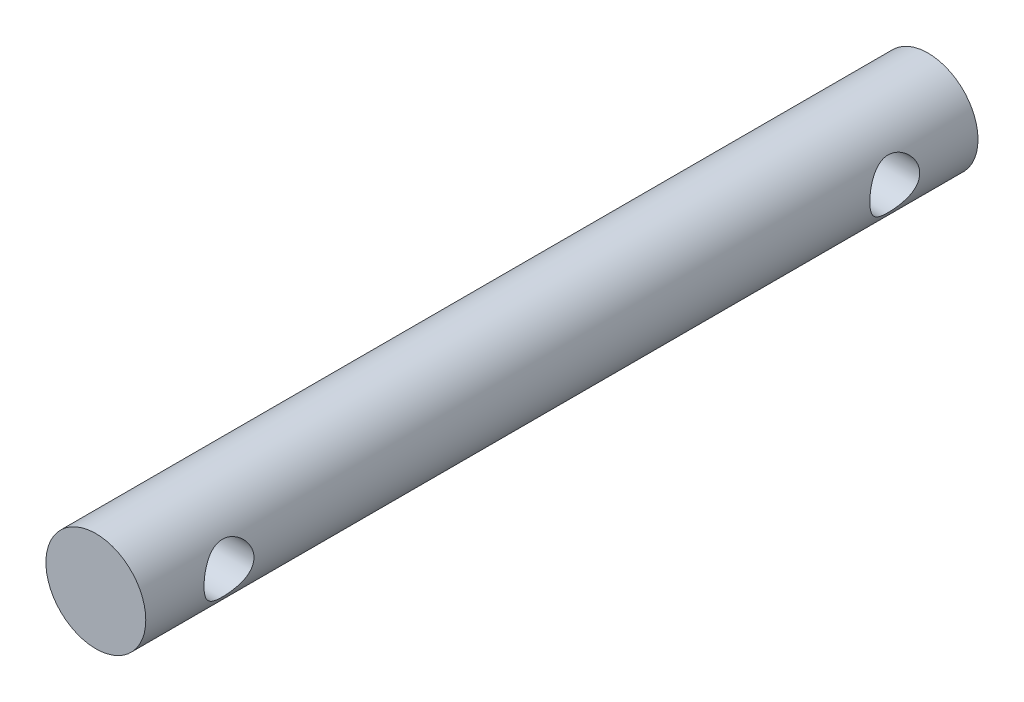
ISO-10303-21;
HEADER;
FILE_DESCRIPTION(('STEP AP214'),'2;1');
FILE_NAME('part.step','',(''),(''),'','','');
FILE_SCHEMA(('AUTOMOTIVE_DESIGN { 1 0 10303 214 1 1 1 1 }'));
ENDSEC;
DATA;
#1=APPLICATION_CONTEXT('core data for automotive mechanical design processes');
#2=APPLICATION_PROTOCOL_DEFINITION('international standard','automotive_design',2000,#1);
#3=PRODUCT_CONTEXT('',#1,'mechanical');
#4=PRODUCT('Part','Part','',(#3));
#5=PRODUCT_RELATED_PRODUCT_CATEGORY('part','',(#4));
#6=PRODUCT_DEFINITION_FORMATION('','',#4);
#7=PRODUCT_DEFINITION_CONTEXT('part definition',#1,'design');
#8=PRODUCT_DEFINITION('design','',#6,#7);
#9=PRODUCT_DEFINITION_SHAPE('','',#8);
#10=(LENGTH_UNIT() NAMED_UNIT(*) SI_UNIT(.MILLI.,.METRE.));
#11=(NAMED_UNIT(*) PLANE_ANGLE_UNIT() SI_UNIT($,.RADIAN.));
#12=(NAMED_UNIT(*) SI_UNIT($,.STERADIAN.) SOLID_ANGLE_UNIT());
#13=UNCERTAINTY_MEASURE_WITH_UNIT(LENGTH_MEASURE(1.E-05),#10,'distance_accuracy_value','');
#14=(GEOMETRIC_REPRESENTATION_CONTEXT(3) GLOBAL_UNCERTAINTY_ASSIGNED_CONTEXT((#13)) GLOBAL_UNIT_ASSIGNED_CONTEXT((#10,
#11,#12)) REPRESENTATION_CONTEXT('',''));
#15=CARTESIAN_POINT('',(0.,0.,0.));
#16=DIRECTION('',(0.,0.,1.));
#17=DIRECTION('',(1.,0.,0.));
#18=AXIS2_PLACEMENT_3D('',#15,#16,#17);
#19=CARTESIAN_POINT('',(0.,0.,50.));
#20=DIRECTION('',(0.,0.,-1.));
#21=DIRECTION('',(-1.,0.,0.));
#22=AXIS2_PLACEMENT_3D('',#19,#20,#21);
#23=CYLINDRICAL_SURFACE('',#22,3.);
#24=CARTESIAN_POINT('',(-3.,0.,46.5));
#25=CARTESIAN_POINT('',(-2.99999570107562,-0.0788579444268501,46.4999950465242));
#26=CARTESIAN_POINT('',(-2.99685736529635,-0.157809899546343,46.4937448903184));
#27=CARTESIAN_POINT('',(-2.98461234055736,-0.313380352903344,46.4690206794877));
#28=CARTESIAN_POINT('',(-2.97549431743379,-0.389994130070445,46.4505234105033));
#29=CARTESIAN_POINT('',(-2.95224419105063,-0.538400317320673,46.4022092870751));
#30=CARTESIAN_POINT('',(-2.93813158766306,-0.610210204408719,46.3724364236281));
#31=CARTESIAN_POINT('',(-2.90618664773642,-0.747708925209898,46.3026440679525));
#32=CARTESIAN_POINT('',(-2.88835460450288,-0.813398240985089,46.2626253836267));
#33=CARTESIAN_POINT('',(-2.84934387387093,-0.941261726642865,46.1707241257721));
#34=CARTESIAN_POINT('',(-2.82802798691306,-1.00298281668316,46.1182702811406));
#35=CARTESIAN_POINT('',(-2.78489955370115,-1.11716916730047,46.0042177811295));
#36=CARTESIAN_POINT('',(-2.76308664313552,-1.16962737466015,45.9426122223413));
#37=CARTESIAN_POINT('',(-2.71948426796021,-1.26787800067542,45.8062749757149));
#38=CARTESIAN_POINT('',(-2.69782780455198,-1.31283800332746,45.7308958524811));
#39=CARTESIAN_POINT('',(-2.65928968158481,-1.38925234033605,45.5724489960207));
#40=CARTESIAN_POINT('',(-2.64240461410484,-1.4207163224495,45.4893868069159));
#41=CARTESIAN_POINT('',(-2.61686800556713,-1.46719866328289,45.3230023418671));
#42=CARTESIAN_POINT('',(-2.6077840737557,-1.48308878562067,45.2399933218989));
#43=CARTESIAN_POINT('',(-2.59772834922791,-1.50064048996327,45.0720317433308));
#44=CARTESIAN_POINT('',(-2.59674854014932,-1.50231613255961,44.9870811886933));
#45=CARTESIAN_POINT('',(-2.60266395385873,-1.49203093075844,44.828570963527));
#46=CARTESIAN_POINT('',(-2.6086314549302,-1.48167683930524,44.7548639531654));
#47=CARTESIAN_POINT('',(-2.62614343100775,-1.4504097735854,44.6104171359404));
#48=CARTESIAN_POINT('',(-2.63768968247664,-1.42949343584648,44.539678282042));
#49=CARTESIAN_POINT('',(-2.66531214619111,-1.37731467057901,44.4011563011515));
#50=CARTESIAN_POINT('',(-2.68148760995998,-1.34582260067399,44.3334804018213));
#51=CARTESIAN_POINT('',(-2.71655106422106,-1.273562531502,44.204048561115));
#52=CARTESIAN_POINT('',(-2.73544027170286,-1.2327903657187,44.1422952965999));
#53=CARTESIAN_POINT('',(-2.77669736854929,-1.13709908236918,44.0182181208852));
#54=CARTESIAN_POINT('',(-2.79920265355119,-1.08104168755392,43.9568146896358));
#55=CARTESIAN_POINT('',(-2.84321434950611,-0.959333368112057,43.8438968721137));
#56=CARTESIAN_POINT('',(-2.86472027938201,-0.893677884861427,43.7923872119492));
#57=CARTESIAN_POINT('',(-2.90552980924446,-0.750774758747772,43.6984715084554));
#58=CARTESIAN_POINT('',(-2.92468476243011,-0.673130387399111,43.6565992913314));
#59=CARTESIAN_POINT('',(-2.95736821681863,-0.510699323233193,43.5868544564355));
#60=CARTESIAN_POINT('',(-2.9709011841533,-0.425918364397913,43.5589707224773));
#61=CARTESIAN_POINT('',(-2.98986500612153,-0.259149737491054,43.520286894425));
#62=CARTESIAN_POINT('',(-2.99587407451965,-0.17751229582249,43.5082631463798));
#63=CARTESIAN_POINT('',(-3.00109520188655,-0.0131693999240295,43.4978029032983));
#64=CARTESIAN_POINT('',(-3.00031048081978,0.0695355298048604,43.4993599715408));
#65=CARTESIAN_POINT('',(-2.99236788380152,0.226849457978976,43.5153100326281));
#66=CARTESIAN_POINT('',(-2.98570868532253,0.301589112074889,43.528698799095));
#67=CARTESIAN_POINT('',(-2.9673325697226,0.447610338452907,43.5663571078427));
#68=CARTESIAN_POINT('',(-2.95561509501618,0.518891528536628,43.5906278496802));
#69=CARTESIAN_POINT('',(-2.92776377120382,0.658332912674358,43.6499976996495));
#70=CARTESIAN_POINT('',(-2.91151322654446,0.726345595508704,43.6853865751744));
#71=CARTESIAN_POINT('',(-2.87615961476126,0.855692042548907,43.7656613034698));
#72=CARTESIAN_POINT('',(-2.85705533350407,0.917022944664888,43.8105512018931));
#73=CARTESIAN_POINT('',(-2.81562332004297,1.03765153393382,43.9136406379961));
#74=CARTESIAN_POINT('',(-2.79316327265249,1.09615811672854,43.9727143026677));
#75=CARTESIAN_POINT('',(-2.7489358741323,1.20278448167829,44.0998877269166));
#76=CARTESIAN_POINT('',(-2.72716901100071,1.25089707856781,44.1679936782719));
#77=CARTESIAN_POINT('',(-2.68576788309734,1.33756187171853,44.3154654812595));
#78=CARTESIAN_POINT('',(-2.66628794383591,1.37553824370037,44.3952168991417));
#79=CARTESIAN_POINT('',(-2.63361108441202,1.43712423890206,44.5612651013625));
#80=CARTESIAN_POINT('',(-2.62040607332625,1.46075237380053,44.6475532897003));
#81=CARTESIAN_POINT('',(-2.60342251538703,1.49079253120031,44.8153653343271));
#82=CARTESIAN_POINT('',(-2.59886075197597,1.49863949460818,44.8965513801529));
#83=CARTESIAN_POINT('',(-2.59748031962405,1.50103373156431,45.0591706007468));
#84=CARTESIAN_POINT('',(-2.60065829439585,1.49558676993487,45.1406036531068));
#85=CARTESIAN_POINT('',(-2.61356793076615,1.47288918838997,45.2932252523002));
#86=CARTESIAN_POINT('',(-2.62264641723987,1.45681247151456,45.3646507052171));
#87=CARTESIAN_POINT('',(-2.64556524281479,1.41476303733662,45.5037121791365));
#88=CARTESIAN_POINT('',(-2.65940711354502,1.38878713673989,45.571346973138));
#89=CARTESIAN_POINT('',(-2.69142795546803,1.32572361795085,45.7059372764798));
#90=CARTESIAN_POINT('',(-2.7098358359388,1.28800670672356,45.7725418527436));
#91=CARTESIAN_POINT('',(-2.7485299745229,1.2032264574561,45.8989118042719));
#92=CARTESIAN_POINT('',(-2.76881720693416,1.15615825686235,45.9586735957817));
#93=CARTESIAN_POINT('',(-2.81193484737138,1.04730498999207,46.077212973532));
#94=CARTESIAN_POINT('',(-2.83477474959942,0.9844266344959,46.1349886535254));
#95=CARTESIAN_POINT('',(-2.87816628389896,0.849232209349804,46.2393944751529));
#96=CARTESIAN_POINT('',(-2.89871667939292,0.776911084957805,46.2860186092049));
#97=CARTESIAN_POINT('',(-2.93547014349806,0.623897395174429,46.3668545440681));
#98=CARTESIAN_POINT('',(-2.95164144740899,0.543149255665107,46.4009762538547));
#99=CARTESIAN_POINT('',(-2.9775201194848,0.37611315170714,46.4547122516361));
#100=CARTESIAN_POINT('',(-2.98724585044602,0.289841699383658,46.4743677702086));
#101=CARTESIAN_POINT('',(-2.99543192870217,0.168902919736349,46.4908461166286));
#102=CARTESIAN_POINT('',(-2.99714048010376,0.135242819162352,46.4942739612995));
#103=CARTESIAN_POINT('',(-2.99942545465223,0.0677275977076395,46.4988519982711));
#104=CARTESIAN_POINT('',(-3.00000184655071,0.0338724714699437,46.5000021277053));
#105=CARTESIAN_POINT('',(-3.,0.,46.5));
#106=B_SPLINE_CURVE_WITH_KNOTS('',3,(#24,#25,#26,#27,#28,#29,#30,#31,#32,#33,#34,#35,#36,#37,
#38,#39,#40,#41,#42,#43,#44,#45,#46,#47,#48,#49,#50,#51,#52,#53,#54,#55,#56,#57,#58,#59,#60,#61,
#62,#63,#64,#65,#66,#67,#68,#69,#70,#71,#72,#73,#74,#75,#76,#77,#78,#79,#80,#81,#82,#83,#84,#85,
#86,#87,#88,#89,#90,#91,#92,#93,#94,#95,#96,#97,#98,#99,#100,#101,#102,#103,#104,#105),
.UNSPECIFIED.,.T.,.F.,(4,2,2,2,2,2,2,2,2,2,2,2,2,2,2,2,2,2,2,2,2,2,2,2,2,2,2,2,2,2,2,2,2,2,2,2,
2,2,2,2,4),(0.,0.236436386130438,0.473322224563797,0.709293233238445,0.945245640872351,
1.19547263807713,1.44588935648105,1.71572589646129,1.98536921847422,2.23887018210345,
2.49212035993531,2.71508568613981,2.93812205888518,3.16635360252732,3.39468781890334,
3.65197412000819,3.90938301898031,4.17874533321662,4.44789325368421,4.6947493570702,
4.94148846767215,5.16910359759184,5.39674382446398,5.63089284041849,5.8651417612251,
6.12239415966629,6.3798238292315,6.6497202324259,6.91926767918177,7.16293961254572,
7.40650589797019,7.62686895373285,7.84730293182528,8.08254685170432,8.31791341715448,
8.58187864135759,8.8459857507187,9.11196020495292,9.37717362931726,9.47872920200878,
9.58028757766602),.UNSPECIFIED.);
#107=CARTESIAN_POINT('',(-3.,0.,46.5));
#108=VERTEX_POINT('',#107);
#109=EDGE_CURVE('E10',#108,#108,#106,.T.);
#110=ORIENTED_EDGE('',*,*,#109,.T.);
#111=EDGE_LOOP('',(#110));
#112=FACE_BOUND('',#111,.T.);
#113=CARTESIAN_POINT('',(3.,0.,43.5));
#114=CARTESIAN_POINT('',(2.99999570107562,-0.0788579444268496,43.5000049534758));
#115=CARTESIAN_POINT('',(2.99685736529635,-0.157809899546343,43.5062551096816));
#116=CARTESIAN_POINT('',(2.98461234055736,-0.313380352903344,43.5309793205123));
#117=CARTESIAN_POINT('',(2.97549431743379,-0.389994130070444,43.5494765894967));
#118=CARTESIAN_POINT('',(2.95224419105063,-0.538400317320673,43.5977907129249));
#119=CARTESIAN_POINT('',(2.93813158766306,-0.610210204408718,43.6275635763719));
#120=CARTESIAN_POINT('',(2.90618664773642,-0.747708925209898,43.6973559320475));
#121=CARTESIAN_POINT('',(2.88835460450288,-0.813398240985089,43.7373746163733));
#122=CARTESIAN_POINT('',(2.84934387387093,-0.941261726642865,43.8292758742279));
#123=CARTESIAN_POINT('',(2.82802798691306,-1.00298281668316,43.8817297188595));
#124=CARTESIAN_POINT('',(2.78489955370115,-1.11716916730047,43.9957822188706));
#125=CARTESIAN_POINT('',(2.76308664313552,-1.16962737466015,44.0573877776587));
#126=CARTESIAN_POINT('',(2.71948426796021,-1.26787800067542,44.1937250242851));
#127=CARTESIAN_POINT('',(2.69782780455198,-1.31283800332746,44.2691041475189));
#128=CARTESIAN_POINT('',(2.65928968158481,-1.38925234033605,44.4275510039793));
#129=CARTESIAN_POINT('',(2.64240461410484,-1.4207163224495,44.5106131930841));
#130=CARTESIAN_POINT('',(2.61686800556713,-1.46719866328289,44.6769976581329));
#131=CARTESIAN_POINT('',(2.6077840737557,-1.48308878562066,44.7600066781011));
#132=CARTESIAN_POINT('',(2.59772834922791,-1.50064048996327,44.9279682566692));
#133=CARTESIAN_POINT('',(2.59674854014932,-1.50231613255961,45.0129188113067));
#134=CARTESIAN_POINT('',(2.60266395385873,-1.49203093075844,45.1714290364731));
#135=CARTESIAN_POINT('',(2.6086314549302,-1.48167683930524,45.2451360468346));
#136=CARTESIAN_POINT('',(2.62614343100775,-1.4504097735854,45.3895828640596));
#137=CARTESIAN_POINT('',(2.63768968247664,-1.42949343584648,45.460321717958));
#138=CARTESIAN_POINT('',(2.66531214619111,-1.37731467057901,45.5988436988485));
#139=CARTESIAN_POINT('',(2.68148760995998,-1.34582260067399,45.6665195981787));
#140=CARTESIAN_POINT('',(2.71655106422105,-1.27356253150201,45.795951438885));
#141=CARTESIAN_POINT('',(2.73544027170286,-1.23279036571871,45.8577047034001));
#142=CARTESIAN_POINT('',(2.77669736854928,-1.13709908236919,45.9817818791148));
#143=CARTESIAN_POINT('',(2.79920265355119,-1.08104168755393,46.0431853103642));
#144=CARTESIAN_POINT('',(2.84321434950611,-0.959333368112067,46.1561031278864));
#145=CARTESIAN_POINT('',(2.86472027938201,-0.893677884861434,46.2076127880508));
#146=CARTESIAN_POINT('',(2.90552980924446,-0.750774758747777,46.3015284915446));
#147=CARTESIAN_POINT('',(2.92468476243011,-0.673130387399116,46.3434007086686));
#148=CARTESIAN_POINT('',(2.95736821681863,-0.510699323233196,46.4131455435645));
#149=CARTESIAN_POINT('',(2.9709011841533,-0.425918364397914,46.4410292775228));
#150=CARTESIAN_POINT('',(2.98986500612153,-0.259149737491053,46.479713105575));
#151=CARTESIAN_POINT('',(2.99587407451965,-0.17751229582249,46.4917368536202));
#152=CARTESIAN_POINT('',(3.00109520188655,-0.0131693999240284,46.5021970967017));
#153=CARTESIAN_POINT('',(3.00031048081978,0.0695355298048616,46.5006400284592));
#154=CARTESIAN_POINT('',(2.99236788380152,0.226849457978979,46.4846899673719));
#155=CARTESIAN_POINT('',(2.98570868532253,0.301589112074894,46.471301200905));
#156=CARTESIAN_POINT('',(2.9673325697226,0.447610338452912,46.4336428921573));
#157=CARTESIAN_POINT('',(2.95561509501618,0.518891528536631,46.4093721503198));
#158=CARTESIAN_POINT('',(2.92776377120382,0.658332912674361,46.3500023003505));
#159=CARTESIAN_POINT('',(2.91151322654446,0.726345595508708,46.3146134248256));
#160=CARTESIAN_POINT('',(2.87615961476126,0.85569204254891,46.2343386965302));
#161=CARTESIAN_POINT('',(2.85705533350407,0.91702294466489,46.1894487981069));
#162=CARTESIAN_POINT('',(2.81562332004297,1.03765153393383,46.0863593620039));
#163=CARTESIAN_POINT('',(2.79316327265249,1.09615811672854,46.0272856973323));
#164=CARTESIAN_POINT('',(2.7489358741323,1.20278448167829,45.9001122730834));
#165=CARTESIAN_POINT('',(2.7271690110007,1.25089707856781,45.8320063217281));
#166=CARTESIAN_POINT('',(2.68576788309734,1.33756187171853,45.6845345187405));
#167=CARTESIAN_POINT('',(2.66628794383591,1.37553824370037,45.6047831008583));
#168=CARTESIAN_POINT('',(2.63361108441202,1.43712423890206,45.4387348986376));
#169=CARTESIAN_POINT('',(2.62040607332625,1.46075237380053,45.3524467102997));
#170=CARTESIAN_POINT('',(2.60342251538703,1.49079253120031,45.184634665673));
#171=CARTESIAN_POINT('',(2.59886075197597,1.49863949460818,45.1034486198471));
#172=CARTESIAN_POINT('',(2.59748031962405,1.50103373156431,44.9408293992532));
#173=CARTESIAN_POINT('',(2.60065829439585,1.49558676993487,44.8593963468932));
#174=CARTESIAN_POINT('',(2.61356793076615,1.47288918838997,44.7067747476999));
#175=CARTESIAN_POINT('',(2.62264641723987,1.45681247151456,44.6353492947829));
#176=CARTESIAN_POINT('',(2.64556524281479,1.41476303733662,44.4962878208635));
#177=CARTESIAN_POINT('',(2.65940711354502,1.38878713673989,44.428653026862));
#178=CARTESIAN_POINT('',(2.69142795546803,1.32572361795085,44.2940627235202));
#179=CARTESIAN_POINT('',(2.70983583593881,1.28800670672355,44.2274581472565));
#180=CARTESIAN_POINT('',(2.7485299745229,1.20322645745609,44.1010881957281));
#181=CARTESIAN_POINT('',(2.76881720693416,1.15615825686235,44.0413264042183));
#182=CARTESIAN_POINT('',(2.81193484737138,1.04730498999207,43.922787026468));
#183=CARTESIAN_POINT('',(2.83477474959942,0.984426634495898,43.8650113464746));
#184=CARTESIAN_POINT('',(2.87816628389896,0.849232209349802,43.7606055248471));
#185=CARTESIAN_POINT('',(2.89871667939292,0.776911084957803,43.7139813907951));
#186=CARTESIAN_POINT('',(2.93547014349806,0.623897395174428,43.6331454559319));
#187=CARTESIAN_POINT('',(2.95164144740899,0.543149255665106,43.5990237461453));
#188=CARTESIAN_POINT('',(2.9775201194848,0.376113151707138,43.5452877483639));
#189=CARTESIAN_POINT('',(2.98724585044602,0.289841699383656,43.5256322297914));
#190=CARTESIAN_POINT('',(2.99543192870217,0.168902919736346,43.5091538833714));
#191=CARTESIAN_POINT('',(2.99714048010376,0.13524281916235,43.5057260387005));
#192=CARTESIAN_POINT('',(2.99942545465223,0.067727597707639,43.5011480017289));
#193=CARTESIAN_POINT('',(3.00000184655071,0.0338724714699439,43.4999978722947));
#194=CARTESIAN_POINT('',(3.,0.,43.5));
#195=B_SPLINE_CURVE_WITH_KNOTS('',3,(#113,#114,#115,#116,#117,#118,#119,#120,#121,#122,#123,
#124,#125,#126,#127,#128,#129,#130,#131,#132,#133,#134,#135,#136,#137,#138,#139,#140,#141,#142,
#143,#144,#145,#146,#147,#148,#149,#150,#151,#152,#153,#154,#155,#156,#157,#158,#159,#160,#161,
#162,#163,#164,#165,#166,#167,#168,#169,#170,#171,#172,#173,#174,#175,#176,#177,#178,#179,#180,
#181,#182,#183,#184,#185,#186,#187,#188,#189,#190,#191,#192,#193,#194),.UNSPECIFIED.,.T.,.F.,(4,
2,2,2,2,2,2,2,2,2,2,2,2,2,2,2,2,2,2,2,2,2,2,2,2,2,2,2,2,2,2,2,2,2,2,2,2,2,2,2,4),(0.,
0.236436386130439,0.473322224563797,0.709293233238445,0.945245640872351,1.19547263807713,
1.44588935648105,1.71572589646129,1.98536921847422,2.23887018210345,2.49212035993531,
2.71508568613981,2.93812205888519,3.16635360252731,3.39468781890333,3.65197412000818,
3.9093830189803,4.17874533321662,4.44789325368421,4.6947493570702,4.94148846767215,
5.16910359759184,5.39674382446398,5.6308928404185,5.8651417612251,6.1223941596663,
6.37982382923149,6.64972023242589,6.91926767918177,7.16293961254571,7.40650589797019,
7.62686895373286,7.84730293182529,8.08254685170432,8.31791341715448,8.58187864135759,
8.8459857507187,9.11196020495291,9.37717362931726,9.47872920200877,9.58028757766601),.UNSPECIFIED.);
#196=CARTESIAN_POINT('',(3.,0.,43.5));
#197=VERTEX_POINT('',#196);
#198=EDGE_CURVE('E42',#197,#197,#195,.T.);
#199=ORIENTED_EDGE('',*,*,#198,.T.);
#200=EDGE_LOOP('',(#199));
#201=FACE_BOUND('',#200,.T.);
#202=CARTESIAN_POINT('',(-3.,0.,6.49999999999999));
#203=CARTESIAN_POINT('',(-2.99999570107562,-0.0788579444268507,6.4999950465242));
#204=CARTESIAN_POINT('',(-2.99685736529635,-0.157809899546345,6.49374489031841));
#205=CARTESIAN_POINT('',(-2.98461234055736,-0.313380352903345,6.4690206794877));
#206=CARTESIAN_POINT('',(-2.97549431743379,-0.389994130070445,6.45052341050328));
#207=CARTESIAN_POINT('',(-2.95224419105063,-0.538400317320673,6.40220928707506));
#208=CARTESIAN_POINT('',(-2.93813158766306,-0.610210204408719,6.37243642362805));
#209=CARTESIAN_POINT('',(-2.90618664773642,-0.747708925209898,6.30264406795252));
#210=CARTESIAN_POINT('',(-2.88835460450288,-0.813398240985089,6.2626253836267));
#211=CARTESIAN_POINT('',(-2.84934387387093,-0.941261726642864,6.17072412577207));
#212=CARTESIAN_POINT('',(-2.82802798691306,-1.00298281668316,6.11827028114054));
#213=CARTESIAN_POINT('',(-2.78489955370115,-1.11716916730047,6.00421778112945));
#214=CARTESIAN_POINT('',(-2.76308664313552,-1.16962737466015,5.94261222234134));
#215=CARTESIAN_POINT('',(-2.71948426796021,-1.26787800067542,5.80627497571493));
#216=CARTESIAN_POINT('',(-2.69782780455198,-1.31283800332746,5.73089585248113));
#217=CARTESIAN_POINT('',(-2.65928968158481,-1.38925234033604,5.57244899602068));
#218=CARTESIAN_POINT('',(-2.64240461410484,-1.4207163224495,5.48938680691588));
#219=CARTESIAN_POINT('',(-2.61686800556713,-1.46719866328288,5.32300234186712));
#220=CARTESIAN_POINT('',(-2.6077840737557,-1.48308878562066,5.23999332189891));
#221=CARTESIAN_POINT('',(-2.59772834922792,-1.50064048996327,5.07203174333078));
#222=CARTESIAN_POINT('',(-2.59674854014932,-1.50231613255961,4.98708118869327));
#223=CARTESIAN_POINT('',(-2.60266395385873,-1.49203093075844,4.82857096352695));
#224=CARTESIAN_POINT('',(-2.6086314549302,-1.48167683930523,4.75486395316543));
#225=CARTESIAN_POINT('',(-2.62614343100775,-1.4504097735854,4.61041713594044));
#226=CARTESIAN_POINT('',(-2.63768968247664,-1.42949343584648,4.53967828204203));
#227=CARTESIAN_POINT('',(-2.66531214619112,-1.37731467057901,4.40115630115151));
#228=CARTESIAN_POINT('',(-2.68148760995998,-1.34582260067399,4.33348040182132));
#229=CARTESIAN_POINT('',(-2.71655106422106,-1.273562531502,4.20404856111499));
#230=CARTESIAN_POINT('',(-2.73544027170286,-1.2327903657187,4.14229529659987));
#231=CARTESIAN_POINT('',(-2.77669736854929,-1.13709908236918,4.01821812088516));
#232=CARTESIAN_POINT('',(-2.79920265355119,-1.08104168755392,3.95681468963576));
#233=CARTESIAN_POINT('',(-2.84321434950611,-0.959333368112061,3.84389687211365));
#234=CARTESIAN_POINT('',(-2.86472027938201,-0.893677884861429,3.79238721194918));
#235=CARTESIAN_POINT('',(-2.90552980924446,-0.750774758747774,3.69847150845541));
#236=CARTESIAN_POINT('',(-2.92468476243011,-0.673130387399114,3.65659929133139));
#237=CARTESIAN_POINT('',(-2.95736821681863,-0.510699323233196,3.58685445643549));
#238=CARTESIAN_POINT('',(-2.9709011841533,-0.425918364397915,3.55897072247725));
#239=CARTESIAN_POINT('',(-2.98986500612153,-0.259149737491054,3.52028689442498));
#240=CARTESIAN_POINT('',(-2.99587407451965,-0.17751229582249,3.50826314637983));
#241=CARTESIAN_POINT('',(-3.00109520188655,-0.0131693999240281,3.49780290329827));
#242=CARTESIAN_POINT('',(-3.00031048081978,0.0695355298048625,3.4993599715408));
#243=CARTESIAN_POINT('',(-2.99236788380152,0.22684945797898,3.51531003262811));
#244=CARTESIAN_POINT('',(-2.98570868532253,0.301589112074895,3.52869879909499));
#245=CARTESIAN_POINT('',(-2.9673325697226,0.447610338452911,3.56635710784268));
#246=CARTESIAN_POINT('',(-2.95561509501618,0.51889152853663,3.59062784968024));
#247=CARTESIAN_POINT('',(-2.92776377120382,0.658332912674359,3.64999769964955));
#248=CARTESIAN_POINT('',(-2.91151322654446,0.726345595508704,3.68538657517443));
#249=CARTESIAN_POINT('',(-2.87615961476126,0.855692042548907,3.76566130346985));
#250=CARTESIAN_POINT('',(-2.85705533350407,0.917022944664887,3.81055120189309));
#251=CARTESIAN_POINT('',(-2.81562332004297,1.03765153393382,3.91364063799607));
#252=CARTESIAN_POINT('',(-2.79316327265249,1.09615811672854,3.97271430266772));
#253=CARTESIAN_POINT('',(-2.7489358741323,1.20278448167828,4.09988772691659));
#254=CARTESIAN_POINT('',(-2.72716901100071,1.25089707856781,4.16799367827188));
#255=CARTESIAN_POINT('',(-2.68576788309734,1.33756187171853,4.31546548125946));
#256=CARTESIAN_POINT('',(-2.66628794383591,1.37553824370037,4.39521689914172));
#257=CARTESIAN_POINT('',(-2.63361108441202,1.43712423890206,4.56126510136245));
#258=CARTESIAN_POINT('',(-2.62040607332625,1.46075237380052,4.64755328970033));
#259=CARTESIAN_POINT('',(-2.60342251538703,1.49079253120031,4.81536533432705));
#260=CARTESIAN_POINT('',(-2.59886075197597,1.49863949460818,4.89655138015286));
#261=CARTESIAN_POINT('',(-2.59748031962405,1.5010337315643,5.05917060074679));
#262=CARTESIAN_POINT('',(-2.60065829439585,1.49558676993486,5.14060365310679));
#263=CARTESIAN_POINT('',(-2.61356793076615,1.47288918838997,5.29322525230016));
#264=CARTESIAN_POINT('',(-2.62264641723988,1.45681247151455,5.36465070521711));
#265=CARTESIAN_POINT('',(-2.64556524281479,1.41476303733662,5.50371217913655));
#266=CARTESIAN_POINT('',(-2.65940711354503,1.38878713673988,5.57134697313805));
#267=CARTESIAN_POINT('',(-2.69142795546804,1.32572361795085,5.70593727647981));
#268=CARTESIAN_POINT('',(-2.70983583593881,1.28800670672355,5.77254185274354));
#269=CARTESIAN_POINT('',(-2.74852997452291,1.20322645745609,5.89891180427189));
#270=CARTESIAN_POINT('',(-2.76881720693416,1.15615825686234,5.95867359578167));
#271=CARTESIAN_POINT('',(-2.81193484737138,1.04730498999206,6.07721297353201));
#272=CARTESIAN_POINT('',(-2.83477474959942,0.984426634495893,6.13498865352544));
#273=CARTESIAN_POINT('',(-2.87816628389896,0.849232209349797,6.2393944751529));
#274=CARTESIAN_POINT('',(-2.89871667939293,0.776911084957797,6.28601860920486));
#275=CARTESIAN_POINT('',(-2.93547014349806,0.62389739517442,6.3668545440681));
#276=CARTESIAN_POINT('',(-2.95164144740899,0.543149255665097,6.4009762538547));
#277=CARTESIAN_POINT('',(-2.9775201194848,0.376113151707131,6.45471225163611));
#278=CARTESIAN_POINT('',(-2.98724585044602,0.289841699383651,6.47436777020857));
#279=CARTESIAN_POINT('',(-2.99543192870217,0.168902919736344,6.49084611662861));
#280=CARTESIAN_POINT('',(-2.99714048010376,0.135242819162348,6.49427396129951));
#281=CARTESIAN_POINT('',(-2.99942545465223,0.0677275977076376,6.49885199827113));
#282=CARTESIAN_POINT('',(-3.00000184655071,0.0338724714699428,6.50000212770531));
#283=CARTESIAN_POINT('',(-3.,0.,6.49999999999999));
#284=B_SPLINE_CURVE_WITH_KNOTS('',3,(#202,#203,#204,#205,#206,#207,#208,#209,#210,#211,#212,
#213,#214,#215,#216,#217,#218,#219,#220,#221,#222,#223,#224,#225,#226,#227,#228,#229,#230,#231,
#232,#233,#234,#235,#236,#237,#238,#239,#240,#241,#242,#243,#244,#245,#246,#247,#248,#249,#250,
#251,#252,#253,#254,#255,#256,#257,#258,#259,#260,#261,#262,#263,#264,#265,#266,#267,#268,#269,
#270,#271,#272,#273,#274,#275,#276,#277,#278,#279,#280,#281,#282,#283),.UNSPECIFIED.,.T.,.F.,(4,
2,2,2,2,2,2,2,2,2,2,2,2,2,2,2,2,2,2,2,2,2,2,2,2,2,2,2,2,2,2,2,2,2,2,2,2,2,2,2,4),(0.,
0.236436386130439,0.473322224563796,0.709293233238446,0.945245640872351,1.19547263807713,
1.44588935648105,1.71572589646129,1.98536921847421,2.23887018210344,2.49212035993531,
2.71508568613981,2.93812205888518,3.16635360252731,3.39468781890333,3.65197412000818,
3.90938301898029,4.17874533321661,4.44789325368419,4.69474935707018,4.94148846767214,
5.16910359759183,5.39674382446397,5.63089284041848,5.86514176122509,6.12239415966628,
6.37982382923148,6.64972023242589,6.91926767918176,7.1629396125457,7.40650589797018,
7.62686895373284,7.84730293182527,8.08254685170431,8.31791341715446,8.58187864135757,
8.84598575071869,9.1119602049529,9.37717362931724,9.47872920200875,9.58028757766599),.UNSPECIFIED.);
#285=CARTESIAN_POINT('',(-3.,0.,6.49999999999999));
#286=VERTEX_POINT('',#285);
#287=EDGE_CURVE('E46',#286,#286,#284,.T.);
#288=ORIENTED_EDGE('',*,*,#287,.T.);
#289=EDGE_LOOP('',(#288));
#290=FACE_BOUND('',#289,.T.);
#291=CARTESIAN_POINT('',(3.,0.,3.5));
#292=CARTESIAN_POINT('',(2.99999570107562,-0.0788579444268502,3.50000495347579));
#293=CARTESIAN_POINT('',(2.99685736529635,-0.157809899546344,3.50625510968158));
#294=CARTESIAN_POINT('',(2.98461234055736,-0.313380352903344,3.53097932051231));
#295=CARTESIAN_POINT('',(2.97549431743379,-0.389994130070444,3.54947658949672));
#296=CARTESIAN_POINT('',(2.95224419105063,-0.538400317320674,3.59779071292494));
#297=CARTESIAN_POINT('',(2.93813158766306,-0.61021020440872,3.62756357637195));
#298=CARTESIAN_POINT('',(2.90618664773642,-0.747708925209898,3.69735593204748));
#299=CARTESIAN_POINT('',(2.88835460450288,-0.813398240985089,3.7373746163733));
#300=CARTESIAN_POINT('',(2.84934387387093,-0.941261726642864,3.82927587422793));
#301=CARTESIAN_POINT('',(2.82802798691306,-1.00298281668316,3.88172971885946));
#302=CARTESIAN_POINT('',(2.78489955370115,-1.11716916730047,3.99578221887056));
#303=CARTESIAN_POINT('',(2.76308664313552,-1.16962737466015,4.05738777765866));
#304=CARTESIAN_POINT('',(2.71948426796021,-1.26787800067542,4.19372502428507));
#305=CARTESIAN_POINT('',(2.69782780455198,-1.31283800332746,4.26910414751887));
#306=CARTESIAN_POINT('',(2.65928968158481,-1.38925234033604,4.42755100397932));
#307=CARTESIAN_POINT('',(2.64240461410484,-1.4207163224495,4.51061319308412));
#308=CARTESIAN_POINT('',(2.61686800556713,-1.46719866328288,4.67699765813288));
#309=CARTESIAN_POINT('',(2.6077840737557,-1.48308878562066,4.76000667810109));
#310=CARTESIAN_POINT('',(2.59772834922792,-1.50064048996327,4.92796825666922));
#311=CARTESIAN_POINT('',(2.59674854014932,-1.50231613255961,5.01291881130673));
#312=CARTESIAN_POINT('',(2.60266395385873,-1.49203093075844,5.17142903647305));
#313=CARTESIAN_POINT('',(2.6086314549302,-1.48167683930523,5.24513604683458));
#314=CARTESIAN_POINT('',(2.62614343100775,-1.4504097735854,5.38958286405956));
#315=CARTESIAN_POINT('',(2.63768968247664,-1.42949343584648,5.46032171795797));
#316=CARTESIAN_POINT('',(2.66531214619112,-1.37731467057901,5.59884369884849));
#317=CARTESIAN_POINT('',(2.68148760995998,-1.34582260067399,5.66651959817868));
#318=CARTESIAN_POINT('',(2.71655106422106,-1.273562531502,5.79595143888501));
#319=CARTESIAN_POINT('',(2.73544027170286,-1.2327903657187,5.85770470340013));
#320=CARTESIAN_POINT('',(2.77669736854929,-1.13709908236918,5.98178187911484));
#321=CARTESIAN_POINT('',(2.79920265355119,-1.08104168755392,6.04318531036424));
#322=CARTESIAN_POINT('',(2.84321434950611,-0.959333368112061,6.15610312788635));
#323=CARTESIAN_POINT('',(2.86472027938201,-0.893677884861429,6.20761278805082));
#324=CARTESIAN_POINT('',(2.90552980924446,-0.750774758747773,6.30152849154459));
#325=CARTESIAN_POINT('',(2.92468476243011,-0.673130387399114,6.34340070866861));
#326=CARTESIAN_POINT('',(2.95736821681863,-0.510699323233196,6.41314554356451));
#327=CARTESIAN_POINT('',(2.9709011841533,-0.425918364397914,6.44102927752275));
#328=CARTESIAN_POINT('',(2.98986500612153,-0.259149737491054,6.47971310557502));
#329=CARTESIAN_POINT('',(2.99587407451965,-0.17751229582249,6.49173685362017));
#330=CARTESIAN_POINT('',(3.00109520188655,-0.0131693999240281,6.50219709670173));
#331=CARTESIAN_POINT('',(3.00031048081978,0.0695355298048629,6.5006400284592));
#332=CARTESIAN_POINT('',(2.99236788380152,0.22684945797898,6.48468996737189));
#333=CARTESIAN_POINT('',(2.98570868532252,0.301589112074895,6.47130120090501));
#334=CARTESIAN_POINT('',(2.9673325697226,0.447610338452912,6.43364289215732));
#335=CARTESIAN_POINT('',(2.95561509501618,0.518891528536631,6.40937215031976));
#336=CARTESIAN_POINT('',(2.92776377120382,0.658332912674359,6.35000230035045));
#337=CARTESIAN_POINT('',(2.91151322654446,0.726345595508705,6.31461342482557));
#338=CARTESIAN_POINT('',(2.87615961476126,0.855692042548907,6.23433869653015));
#339=CARTESIAN_POINT('',(2.85705533350407,0.917022944664888,6.18944879810691));
#340=CARTESIAN_POINT('',(2.81562332004297,1.03765153393382,6.08635936200393));
#341=CARTESIAN_POINT('',(2.79316327265249,1.09615811672854,6.02728569733228));
#342=CARTESIAN_POINT('',(2.7489358741323,1.20278448167828,5.90011227308341));
#343=CARTESIAN_POINT('',(2.72716901100071,1.25089707856781,5.83200632172812));
#344=CARTESIAN_POINT('',(2.68576788309734,1.33756187171853,5.68453451874054));
#345=CARTESIAN_POINT('',(2.66628794383591,1.37553824370037,5.60478310085828));
#346=CARTESIAN_POINT('',(2.63361108441202,1.43712423890206,5.43873489863755));
#347=CARTESIAN_POINT('',(2.62040607332625,1.46075237380053,5.35244671029966));
#348=CARTESIAN_POINT('',(2.60342251538703,1.49079253120031,5.18463466567294));
#349=CARTESIAN_POINT('',(2.59886075197597,1.49863949460818,5.10344861984714));
#350=CARTESIAN_POINT('',(2.59748031962405,1.5010337315643,4.94082939925321));
#351=CARTESIAN_POINT('',(2.60065829439585,1.49558676993486,4.85939634689321));
#352=CARTESIAN_POINT('',(2.61356793076615,1.47288918838997,4.70677474769984));
#353=CARTESIAN_POINT('',(2.62264641723988,1.45681247151455,4.63534929478289));
#354=CARTESIAN_POINT('',(2.64556524281479,1.41476303733662,4.49628782086345));
#355=CARTESIAN_POINT('',(2.65940711354503,1.38878713673988,4.42865302686195));
#356=CARTESIAN_POINT('',(2.69142795546804,1.32572361795085,4.29406272352019));
#357=CARTESIAN_POINT('',(2.70983583593881,1.28800670672355,4.22745814725646));
#358=CARTESIAN_POINT('',(2.74852997452291,1.20322645745609,4.10108819572811));
#359=CARTESIAN_POINT('',(2.76881720693416,1.15615825686234,4.04132640421833));
#360=CARTESIAN_POINT('',(2.81193484737138,1.04730498999206,3.92278702646799));
#361=CARTESIAN_POINT('',(2.83477474959942,0.984426634495893,3.86501134647456));
#362=CARTESIAN_POINT('',(2.87816628389896,0.849232209349797,3.7606055248471));
#363=CARTESIAN_POINT('',(2.89871667939293,0.776911084957797,3.71398139079514));
#364=CARTESIAN_POINT('',(2.93547014349806,0.623897395174419,3.63314545593189));
#365=CARTESIAN_POINT('',(2.95164144740899,0.543149255665095,3.5990237461453));
#366=CARTESIAN_POINT('',(2.9775201194848,0.376113151707129,3.54528774836389));
#367=CARTESIAN_POINT('',(2.98724585044602,0.28984169938365,3.52563222979143));
#368=CARTESIAN_POINT('',(2.99543192870217,0.168902919736343,3.50915388337139));
#369=CARTESIAN_POINT('',(2.99714048010376,0.135242819162348,3.50572603870049));
#370=CARTESIAN_POINT('',(2.99942545465223,0.0677275977076379,3.50114800172887));
#371=CARTESIAN_POINT('',(3.00000184655071,0.0338724714699429,3.49999787229469));
#372=CARTESIAN_POINT('',(3.,0.,3.5));
#373=B_SPLINE_CURVE_WITH_KNOTS('',3,(#291,#292,#293,#294,#295,#296,#297,#298,#299,#300,#301,
#302,#303,#304,#305,#306,#307,#308,#309,#310,#311,#312,#313,#314,#315,#316,#317,#318,#319,#320,
#321,#322,#323,#324,#325,#326,#327,#328,#329,#330,#331,#332,#333,#334,#335,#336,#337,#338,#339,
#340,#341,#342,#343,#344,#345,#346,#347,#348,#349,#350,#351,#352,#353,#354,#355,#356,#357,#358,
#359,#360,#361,#362,#363,#364,#365,#366,#367,#368,#369,#370,#371,#372),.UNSPECIFIED.,.T.,.F.,(4,
2,2,2,2,2,2,2,2,2,2,2,2,2,2,2,2,2,2,2,2,2,2,2,2,2,2,2,2,2,2,2,2,2,2,2,2,2,2,2,4),(0.,
0.236436386130439,0.473322224563797,0.709293233238448,0.945245640872352,1.19547263807713,
1.44588935648105,1.71572589646129,1.98536921847422,2.23887018210344,2.49212035993531,
2.71508568613981,2.93812205888518,3.16635360252731,3.39468781890333,3.65197412000818,
3.9093830189803,4.17874533321661,4.4478932536842,4.69474935707019,4.94148846767214,
5.16910359759183,5.39674382446398,5.63089284041848,5.86514176122509,6.12239415966629,
6.37982382923148,6.64972023242589,6.91926767918177,7.1629396125457,7.40650589797018,
7.62686895373284,7.84730293182527,8.08254685170431,8.31791341715446,8.58187864135758,
8.84598575071869,9.11196020495291,9.37717362931724,9.47872920200876,9.580287577666),.UNSPECIFIED.);
#374=CARTESIAN_POINT('',(3.,0.,3.5));
#375=VERTEX_POINT('',#374);
#376=EDGE_CURVE('E50',#375,#375,#373,.T.);
#377=ORIENTED_EDGE('',*,*,#376,.T.);
#378=EDGE_LOOP('',(#377));
#379=FACE_BOUND('',#378,.T.);
#380=CARTESIAN_POINT('',(0.,0.,50.));
#381=DIRECTION('',(0.,0.,1.));
#382=DIRECTION('',(1.,0.,0.));
#383=AXIS2_PLACEMENT_3D('',#380,#381,#382);
#384=CIRCLE('',#383,3.);
#385=CARTESIAN_POINT('',(3.,0.,50.));
#386=VERTEX_POINT('',#385);
#387=EDGE_CURVE('E78',#386,#386,#384,.T.);
#388=ORIENTED_EDGE('',*,*,#387,.F.);
#389=EDGE_LOOP('',(#388));
#390=FACE_BOUND('',#389,.T.);
#391=CARTESIAN_POINT('',(0.,0.,0.));
#392=DIRECTION('',(0.,0.,1.));
#393=DIRECTION('',(1.,0.,0.));
#394=AXIS2_PLACEMENT_3D('',#391,#392,#393);
#395=CIRCLE('',#394,3.);
#396=CARTESIAN_POINT('',(3.,0.,0.));
#397=VERTEX_POINT('',#396);
#398=EDGE_CURVE('E79',#397,#397,#395,.T.);
#399=ORIENTED_EDGE('',*,*,#398,.T.);
#400=EDGE_LOOP('',(#399));
#401=FACE_BOUND('',#400,.T.);
#402=ADVANCED_FACE('F31',(#112,#201,#290,#379,#390,#401),#23,.T.);
#403=CARTESIAN_POINT('',(0.,0.,50.));
#404=DIRECTION('',(0.,0.,1.));
#405=DIRECTION('',(1.,0.,0.));
#406=AXIS2_PLACEMENT_3D('',#403,#404,#405);
#407=PLANE('',#406);
#408=ORIENTED_EDGE('',*,*,#387,.T.);
#409=EDGE_LOOP('',(#408));
#410=FACE_BOUND('',#409,.T.);
#411=ADVANCED_FACE('F71',(#410),#407,.T.);
#412=CARTESIAN_POINT('',(0.,0.,0.));
#413=DIRECTION('',(0.,0.,1.));
#414=DIRECTION('',(1.,0.,0.));
#415=AXIS2_PLACEMENT_3D('',#412,#413,#414);
#416=PLANE('',#415);
#417=ORIENTED_EDGE('',*,*,#398,.F.);
#418=EDGE_LOOP('',(#417));
#419=FACE_BOUND('',#418,.T.);
#420=ADVANCED_FACE('F69',(#419),#416,.F.);
#421=CARTESIAN_POINT('',(-3.,0.,5.));
#422=DIRECTION('',(1.,0.,0.));
#423=DIRECTION('',(0.,0.,-1.));
#424=AXIS2_PLACEMENT_3D('',#421,#422,#423);
#425=CYLINDRICAL_SURFACE('',#424,1.5);
#426=ORIENTED_EDGE('',*,*,#376,.F.);
#427=EDGE_LOOP('',(#426));
#428=FACE_BOUND('',#427,.T.);
#429=ORIENTED_EDGE('',*,*,#287,.F.);
#430=EDGE_LOOP('',(#429));
#431=FACE_BOUND('',#430,.T.);
#432=ADVANCED_FACE('F63',(#428,#431),#425,.F.);
#433=CARTESIAN_POINT('',(-3.,0.,45.));
#434=DIRECTION('',(1.,0.,0.));
#435=DIRECTION('',(0.,0.,-1.));
#436=AXIS2_PLACEMENT_3D('',#433,#434,#435);
#437=CYLINDRICAL_SURFACE('',#436,1.5);
#438=ORIENTED_EDGE('',*,*,#198,.F.);
#439=EDGE_LOOP('',(#438));
#440=FACE_BOUND('',#439,.T.);
#441=ORIENTED_EDGE('',*,*,#109,.F.);
#442=EDGE_LOOP('',(#441));
#443=FACE_BOUND('',#442,.T.);
#444=ADVANCED_FACE('F60',(#440,#443),#437,.F.);
#445=CLOSED_SHELL('',(#402,#411,#420,#432,#444));
#446=MANIFOLD_SOLID_BREP('B2',#445);
#447=ADVANCED_BREP_SHAPE_REPRESENTATION('',(#18,#446),#14);
#448=SHAPE_DEFINITION_REPRESENTATION(#9,#447);
ENDSEC;
END-ISO-10303-21;
